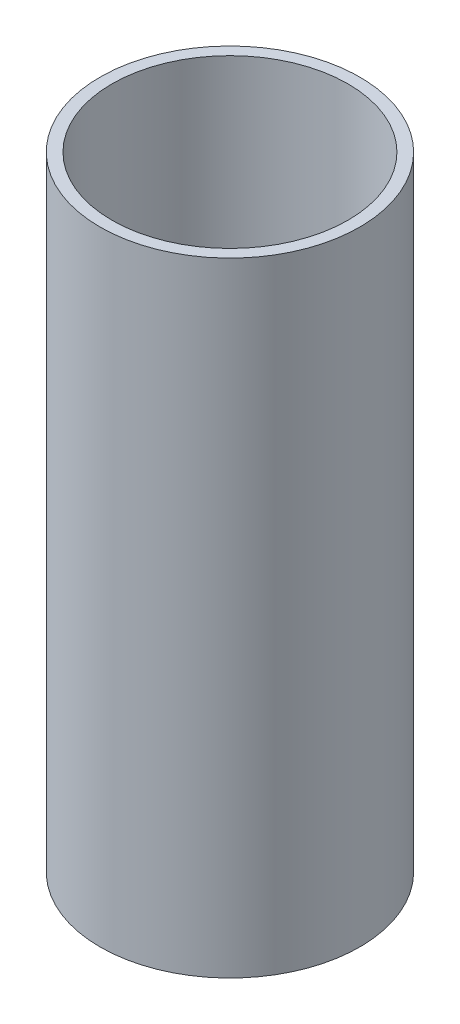
ISO-10303-21;
HEADER;
FILE_DESCRIPTION(('STEP AP214'),'2;1');
FILE_NAME('part.step','',(''),(''),'','','');
FILE_SCHEMA(('AUTOMOTIVE_DESIGN { 1 0 10303 214 1 1 1 1 }'));
ENDSEC;
DATA;
#1=APPLICATION_CONTEXT('core data for automotive mechanical design processes');
#2=APPLICATION_PROTOCOL_DEFINITION('international standard','automotive_design',2000,#1);
#3=PRODUCT_CONTEXT('',#1,'mechanical');
#4=PRODUCT('Part','Part','',(#3));
#5=PRODUCT_RELATED_PRODUCT_CATEGORY('part','',(#4));
#6=PRODUCT_DEFINITION_FORMATION('','',#4);
#7=PRODUCT_DEFINITION_CONTEXT('part definition',#1,'design');
#8=PRODUCT_DEFINITION('design','',#6,#7);
#9=PRODUCT_DEFINITION_SHAPE('','',#8);
#10=(LENGTH_UNIT() NAMED_UNIT(*) SI_UNIT(.MILLI.,.METRE.));
#11=(NAMED_UNIT(*) PLANE_ANGLE_UNIT() SI_UNIT($,.RADIAN.));
#12=(NAMED_UNIT(*) SI_UNIT($,.STERADIAN.) SOLID_ANGLE_UNIT());
#13=UNCERTAINTY_MEASURE_WITH_UNIT(LENGTH_MEASURE(1.E-05),#10,'distance_accuracy_value','');
#14=(GEOMETRIC_REPRESENTATION_CONTEXT(3) GLOBAL_UNCERTAINTY_ASSIGNED_CONTEXT((#13)) GLOBAL_UNIT_ASSIGNED_CONTEXT((#10,
#11,#12)) REPRESENTATION_CONTEXT('',''));
#15=CARTESIAN_POINT('',(0.,0.,0.));
#16=DIRECTION('',(0.,0.,1.));
#17=DIRECTION('',(1.,0.,0.));
#18=AXIS2_PLACEMENT_3D('',#15,#16,#17);
#19=CARTESIAN_POINT('',(0.,264.,0.));
#20=DIRECTION('',(0.,1.,0.));
#21=DIRECTION('',(0.,0.,1.));
#22=AXIS2_PLACEMENT_3D('',#19,#20,#21);
#23=PLANE('',#22);
#24=CARTESIAN_POINT('',(0.,264.,0.));
#25=DIRECTION('',(0.,1.,0.));
#26=DIRECTION('',(0.,0.,1.));
#27=AXIS2_PLACEMENT_3D('',#24,#25,#26);
#28=CIRCLE('',#27,55.);
#29=CARTESIAN_POINT('',(0.,264.,55.));
#30=VERTEX_POINT('',#29);
#31=EDGE_CURVE('E10',#30,#30,#28,.T.);
#32=ORIENTED_EDGE('',*,*,#31,.T.);
#33=EDGE_LOOP('',(#32));
#34=FACE_BOUND('',#33,.T.);
#35=CARTESIAN_POINT('',(0.,264.,0.));
#36=DIRECTION('',(0.,1.,0.));
#37=DIRECTION('',(0.,0.,1.));
#38=AXIS2_PLACEMENT_3D('',#35,#36,#37);
#39=CIRCLE('',#38,50.);
#40=CARTESIAN_POINT('',(0.,264.,50.));
#41=VERTEX_POINT('',#40);
#42=EDGE_CURVE('E42',#41,#41,#39,.T.);
#43=ORIENTED_EDGE('',*,*,#42,.F.);
#44=EDGE_LOOP('',(#43));
#45=FACE_BOUND('',#44,.T.);
#46=ADVANCED_FACE('F31',(#34,#45),#23,.T.);
#47=CARTESIAN_POINT('',(0.,0.,0.));
#48=DIRECTION('',(0.,1.,0.));
#49=DIRECTION('',(0.,0.,1.));
#50=AXIS2_PLACEMENT_3D('',#47,#48,#49);
#51=PLANE('',#50);
#52=CARTESIAN_POINT('',(0.,0.,0.));
#53=DIRECTION('',(0.,1.,0.));
#54=DIRECTION('',(0.,0.,1.));
#55=AXIS2_PLACEMENT_3D('',#52,#53,#54);
#56=CIRCLE('',#55,55.);
#57=CARTESIAN_POINT('',(0.,0.,55.));
#58=VERTEX_POINT('',#57);
#59=EDGE_CURVE('E35',#58,#58,#56,.T.);
#60=ORIENTED_EDGE('',*,*,#59,.F.);
#61=EDGE_LOOP('',(#60));
#62=FACE_BOUND('',#61,.T.);
#63=CARTESIAN_POINT('',(0.,0.,0.));
#64=DIRECTION('',(0.,1.,0.));
#65=DIRECTION('',(0.,0.,1.));
#66=AXIS2_PLACEMENT_3D('',#63,#64,#65);
#67=CIRCLE('',#66,50.);
#68=CARTESIAN_POINT('',(0.,0.,50.));
#69=VERTEX_POINT('',#68);
#70=EDGE_CURVE('E44',#69,#69,#67,.T.);
#71=ORIENTED_EDGE('',*,*,#70,.T.);
#72=EDGE_LOOP('',(#71));
#73=FACE_BOUND('',#72,.T.);
#74=ADVANCED_FACE('F54',(#62,#73),#51,.F.);
#75=CARTESIAN_POINT('',(0.,264.,0.));
#76=DIRECTION('',(0.,-1.,0.));
#77=DIRECTION('',(0.,0.,-1.));
#78=AXIS2_PLACEMENT_3D('',#75,#76,#77);
#79=CYLINDRICAL_SURFACE('',#78,55.);
#80=ORIENTED_EDGE('',*,*,#31,.F.);
#81=EDGE_LOOP('',(#80));
#82=FACE_BOUND('',#81,.T.);
#83=ORIENTED_EDGE('',*,*,#59,.T.);
#84=EDGE_LOOP('',(#83));
#85=FACE_BOUND('',#84,.T.);
#86=ADVANCED_FACE('F33',(#82,#85),#79,.T.);
#87=CARTESIAN_POINT('',(0.,264.,0.));
#88=DIRECTION('',(0.,-1.,0.));
#89=DIRECTION('',(0.,0.,-1.));
#90=AXIS2_PLACEMENT_3D('',#87,#88,#89);
#91=CYLINDRICAL_SURFACE('',#90,50.);
#92=ORIENTED_EDGE('',*,*,#42,.T.);
#93=EDGE_LOOP('',(#92));
#94=FACE_BOUND('',#93,.T.);
#95=ORIENTED_EDGE('',*,*,#70,.F.);
#96=EDGE_LOOP('',(#95));
#97=FACE_BOUND('',#96,.T.);
#98=ADVANCED_FACE('F50',(#94,#97),#91,.F.);
#99=CLOSED_SHELL('',(#46,#74,#86,#98));
#100=MANIFOLD_SOLID_BREP('B2',#99);
#101=ADVANCED_BREP_SHAPE_REPRESENTATION('',(#18,#100),#14);
#102=SHAPE_DEFINITION_REPRESENTATION(#9,#101);
ENDSEC;
END-ISO-10303-21;
